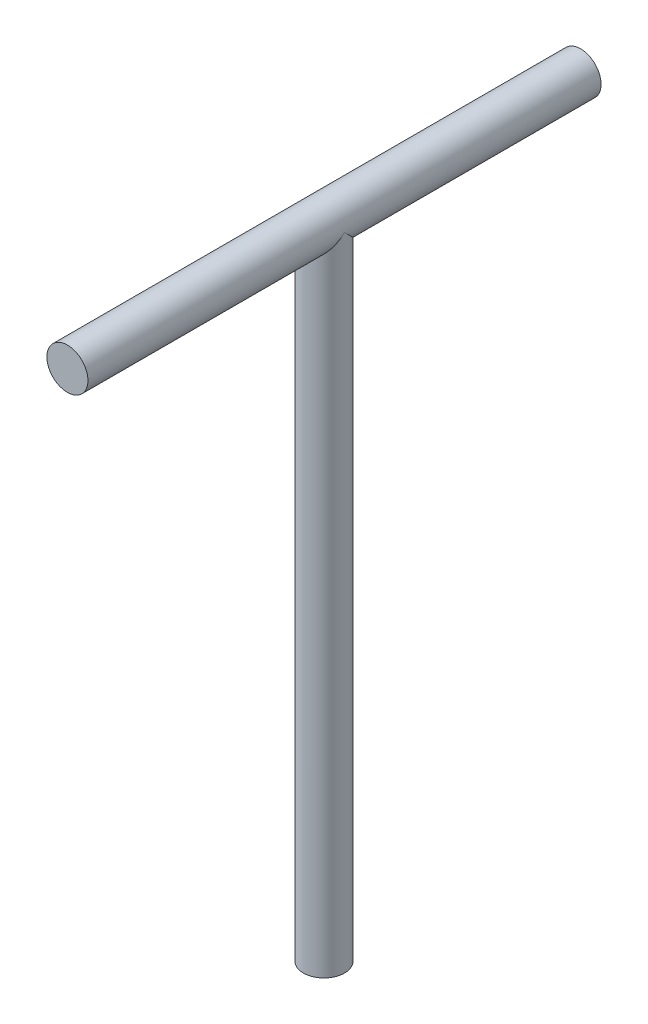
ISO-10303-21;
HEADER;
FILE_DESCRIPTION(('STEP AP214'),'2;1');
FILE_NAME('part.step','',(''),(''),'','','');
FILE_SCHEMA(('AUTOMOTIVE_DESIGN { 1 0 10303 214 1 1 1 1 }'));
ENDSEC;
DATA;
#1=APPLICATION_CONTEXT('core data for automotive mechanical design processes');
#2=APPLICATION_PROTOCOL_DEFINITION('international standard','automotive_design',2000,#1);
#3=PRODUCT_CONTEXT('',#1,'mechanical');
#4=PRODUCT('Part','Part','',(#3));
#5=PRODUCT_RELATED_PRODUCT_CATEGORY('part','',(#4));
#6=PRODUCT_DEFINITION_FORMATION('','',#4);
#7=PRODUCT_DEFINITION_CONTEXT('part definition',#1,'design');
#8=PRODUCT_DEFINITION('design','',#6,#7);
#9=PRODUCT_DEFINITION_SHAPE('','',#8);
#10=(LENGTH_UNIT() NAMED_UNIT(*) SI_UNIT(.MILLI.,.METRE.));
#11=(NAMED_UNIT(*) PLANE_ANGLE_UNIT() SI_UNIT($,.RADIAN.));
#12=(NAMED_UNIT(*) SI_UNIT($,.STERADIAN.) SOLID_ANGLE_UNIT());
#13=UNCERTAINTY_MEASURE_WITH_UNIT(LENGTH_MEASURE(1.E-05),#10,'distance_accuracy_value','');
#14=(GEOMETRIC_REPRESENTATION_CONTEXT(3) GLOBAL_UNCERTAINTY_ASSIGNED_CONTEXT((#13)) GLOBAL_UNIT_ASSIGNED_CONTEXT((#10,
#11,#12)) REPRESENTATION_CONTEXT('',''));
#15=CARTESIAN_POINT('',(0.,0.,0.));
#16=DIRECTION('',(0.,0.,1.));
#17=DIRECTION('',(1.,0.,0.));
#18=AXIS2_PLACEMENT_3D('',#15,#16,#17);
#19=CARTESIAN_POINT('',(0.,0.,200.));
#20=DIRECTION('',(0.,0.,-1.));
#21=DIRECTION('',(-1.,0.,0.));
#22=AXIS2_PLACEMENT_3D('',#19,#20,#21);
#23=CYLINDRICAL_SURFACE('',#22,16.);
#24=CARTESIAN_POINT('',(0.,0.,0.));
#25=DIRECTION('',(0.,-0.707106781186547,-0.707106781186547));
#26=DIRECTION('',(0.,0.707106781186547,-0.707106781186547));
#27=AXIS2_PLACEMENT_3D('',#24,#25,#26);
#28=ELLIPSE('',#27,22.6274169979695,16.);
#29=CARTESIAN_POINT('',(-16.,0.,0.));
#30=VERTEX_POINT('',#29);
#31=CARTESIAN_POINT('',(16.,0.,0.));
#32=VERTEX_POINT('',#31);
#33=EDGE_CURVE('E46',#30,#32,#28,.F.);
#34=ORIENTED_EDGE('',*,*,#33,.T.);
#35=CARTESIAN_POINT('',(0.,0.,0.));
#36=DIRECTION('',(0.,0.707106781186547,-0.707106781186547));
#37=DIRECTION('',(0.,-0.707106781186547,-0.707106781186547));
#38=AXIS2_PLACEMENT_3D('',#35,#36,#37);
#39=ELLIPSE('',#38,22.6274169979695,16.);
#40=EDGE_CURVE('E11',#32,#30,#39,.T.);
#41=ORIENTED_EDGE('',*,*,#40,.T.);
#42=EDGE_LOOP('',(#34,#41));
#43=FACE_BOUND('',#42,.T.);
#44=CARTESIAN_POINT('',(0.,0.,200.));
#45=DIRECTION('',(0.,0.,1.));
#46=DIRECTION('',(1.,0.,0.));
#47=AXIS2_PLACEMENT_3D('',#44,#45,#46);
#48=CIRCLE('',#47,16.);
#49=CARTESIAN_POINT('',(16.,0.,200.));
#50=VERTEX_POINT('',#49);
#51=EDGE_CURVE('E54',#50,#50,#48,.T.);
#52=ORIENTED_EDGE('',*,*,#51,.F.);
#53=EDGE_LOOP('',(#52));
#54=FACE_BOUND('',#53,.T.);
#55=CARTESIAN_POINT('',(0.,0.,-200.));
#56=DIRECTION('',(0.,0.,1.));
#57=DIRECTION('',(1.,0.,0.));
#58=AXIS2_PLACEMENT_3D('',#55,#56,#57);
#59=CIRCLE('',#58,16.);
#60=CARTESIAN_POINT('',(16.,0.,-200.));
#61=VERTEX_POINT('',#60);
#62=EDGE_CURVE('E63',#61,#61,#59,.T.);
#63=ORIENTED_EDGE('',*,*,#62,.T.);
#64=EDGE_LOOP('',(#63));
#65=FACE_BOUND('',#64,.T.);
#66=ADVANCED_FACE('F39',(#43,#54,#65),#23,.T.);
#67=CARTESIAN_POINT('',(0.,0.,200.));
#68=DIRECTION('',(0.,0.,1.));
#69=DIRECTION('',(1.,0.,0.));
#70=AXIS2_PLACEMENT_3D('',#67,#68,#69);
#71=PLANE('',#70);
#72=ORIENTED_EDGE('',*,*,#51,.T.);
#73=EDGE_LOOP('',(#72));
#74=FACE_BOUND('',#73,.T.);
#75=ADVANCED_FACE('F57',(#74),#71,.T.);
#76=CARTESIAN_POINT('',(0.,0.,-200.));
#77=DIRECTION('',(0.,0.,1.));
#78=DIRECTION('',(1.,0.,0.));
#79=AXIS2_PLACEMENT_3D('',#76,#77,#78);
#80=PLANE('',#79);
#81=ORIENTED_EDGE('',*,*,#62,.F.);
#82=EDGE_LOOP('',(#81));
#83=FACE_BOUND('',#82,.T.);
#84=ADVANCED_FACE('F79',(#83),#80,.F.);
#85=CARTESIAN_POINT('',(0.,-500.,0.));
#86=DIRECTION('',(0.,1.,0.));
#87=DIRECTION('',(0.,0.,1.));
#88=AXIS2_PLACEMENT_3D('',#85,#86,#87);
#89=CYLINDRICAL_SURFACE('',#88,16.);
#90=CARTESIAN_POINT('',(0.,-500.,0.));
#91=DIRECTION('',(0.,1.,0.));
#92=DIRECTION('',(0.,0.,1.));
#93=AXIS2_PLACEMENT_3D('',#90,#91,#92);
#94=CIRCLE('',#93,16.);
#95=CARTESIAN_POINT('',(0.,-500.,16.));
#96=VERTEX_POINT('',#95);
#97=EDGE_CURVE('E65',#96,#96,#94,.T.);
#98=ORIENTED_EDGE('',*,*,#97,.T.);
#99=EDGE_LOOP('',(#98));
#100=FACE_BOUND('',#99,.T.);
#101=ORIENTED_EDGE('',*,*,#40,.F.);
#102=ORIENTED_EDGE('',*,*,#33,.F.);
#103=EDGE_LOOP('',(#101,#102));
#104=FACE_BOUND('',#103,.T.);
#105=ADVANCED_FACE('F52',(#100,#104),#89,.T.);
#106=CARTESIAN_POINT('',(0.,-500.,0.));
#107=DIRECTION('',(0.,1.,0.));
#108=DIRECTION('',(0.,0.,1.));
#109=AXIS2_PLACEMENT_3D('',#106,#107,#108);
#110=PLANE('',#109);
#111=ORIENTED_EDGE('',*,*,#97,.F.);
#112=EDGE_LOOP('',(#111));
#113=FACE_BOUND('',#112,.T.);
#114=ADVANCED_FACE('F73',(#113),#110,.F.);
#115=CLOSED_SHELL('',(#66,#75,#84,#105,#114));
#116=MANIFOLD_SOLID_BREP('B2',#115);
#117=ADVANCED_BREP_SHAPE_REPRESENTATION('',(#18,#116),#14);
#118=SHAPE_DEFINITION_REPRESENTATION(#9,#117);
ENDSEC;
END-ISO-10303-21;
